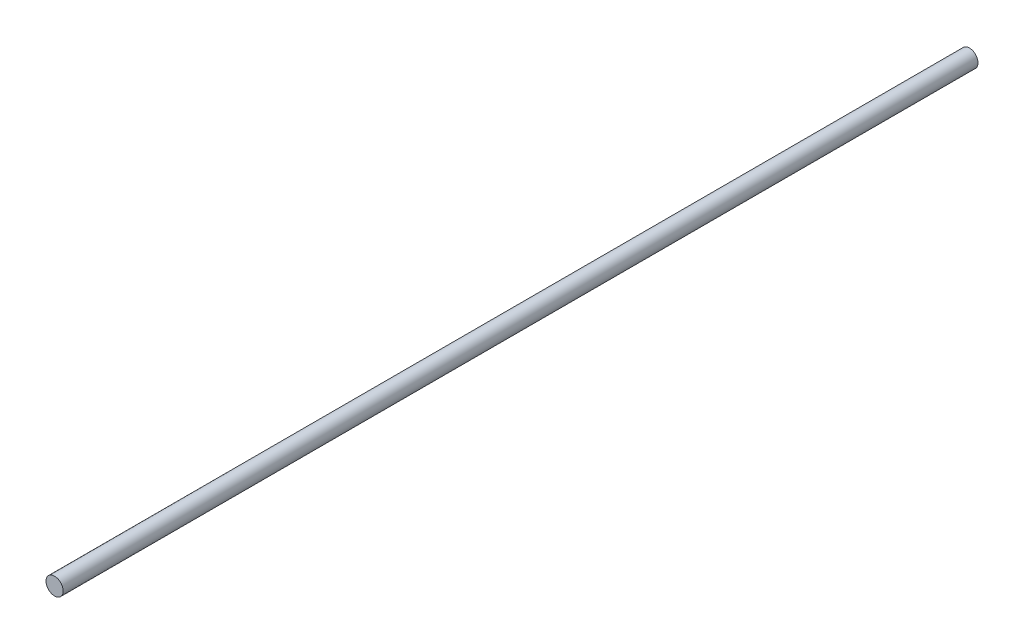
ISO-10303-21;
HEADER;
FILE_DESCRIPTION(('STEP AP214'),'2;1');
FILE_NAME('part.step','',(''),(''),'','','');
FILE_SCHEMA(('AUTOMOTIVE_DESIGN { 1 0 10303 214 1 1 1 1 }'));
ENDSEC;
DATA;
#1=APPLICATION_CONTEXT('core data for automotive mechanical design processes');
#2=APPLICATION_PROTOCOL_DEFINITION('international standard','automotive_design',2000,#1);
#3=PRODUCT_CONTEXT('',#1,'mechanical');
#4=PRODUCT('Part','Part','',(#3));
#5=PRODUCT_RELATED_PRODUCT_CATEGORY('part','',(#4));
#6=PRODUCT_DEFINITION_FORMATION('','',#4);
#7=PRODUCT_DEFINITION_CONTEXT('part definition',#1,'design');
#8=PRODUCT_DEFINITION('design','',#6,#7);
#9=PRODUCT_DEFINITION_SHAPE('','',#8);
#10=(LENGTH_UNIT() NAMED_UNIT(*) SI_UNIT(.MILLI.,.METRE.));
#11=(NAMED_UNIT(*) PLANE_ANGLE_UNIT() SI_UNIT($,.RADIAN.));
#12=(NAMED_UNIT(*) SI_UNIT($,.STERADIAN.) SOLID_ANGLE_UNIT());
#13=UNCERTAINTY_MEASURE_WITH_UNIT(LENGTH_MEASURE(1.E-05),#10,'distance_accuracy_value','');
#14=(GEOMETRIC_REPRESENTATION_CONTEXT(3) GLOBAL_UNCERTAINTY_ASSIGNED_CONTEXT((#13)) GLOBAL_UNIT_ASSIGNED_CONTEXT((#10,
#11,#12)) REPRESENTATION_CONTEXT('',''));
#15=CARTESIAN_POINT('',(0.,0.,0.));
#16=DIRECTION('',(0.,0.,1.));
#17=DIRECTION('',(1.,0.,0.));
#18=AXIS2_PLACEMENT_3D('',#15,#16,#17);
#19=CARTESIAN_POINT('',(0.,0.,426.));
#20=DIRECTION('',(0.,0.,-1.));
#21=DIRECTION('',(-1.,0.,0.));
#22=AXIS2_PLACEMENT_3D('',#19,#20,#21);
#23=CYLINDRICAL_SURFACE('',#22,4.);
#24=CARTESIAN_POINT('',(0.,0.,426.));
#25=DIRECTION('',(0.,0.,1.));
#26=DIRECTION('',(1.,0.,0.));
#27=AXIS2_PLACEMENT_3D('',#24,#25,#26);
#28=CIRCLE('',#27,4.);
#29=CARTESIAN_POINT('',(4.,0.,426.));
#30=VERTEX_POINT('',#29);
#31=EDGE_CURVE('E10',#30,#30,#28,.T.);
#32=ORIENTED_EDGE('',*,*,#31,.F.);
#33=EDGE_LOOP('',(#32));
#34=FACE_BOUND('',#33,.T.);
#35=CARTESIAN_POINT('',(0.,0.,0.));
#36=DIRECTION('',(0.,0.,1.));
#37=DIRECTION('',(1.,0.,0.));
#38=AXIS2_PLACEMENT_3D('',#35,#36,#37);
#39=CIRCLE('',#38,4.);
#40=CARTESIAN_POINT('',(4.,0.,0.));
#41=VERTEX_POINT('',#40);
#42=EDGE_CURVE('E40',#41,#41,#39,.T.);
#43=ORIENTED_EDGE('',*,*,#42,.T.);
#44=EDGE_LOOP('',(#43));
#45=FACE_BOUND('',#44,.T.);
#46=ADVANCED_FACE('F37',(#34,#45),#23,.T.);
#47=CARTESIAN_POINT('',(0.,0.,426.));
#48=DIRECTION('',(0.,0.,1.));
#49=DIRECTION('',(1.,0.,0.));
#50=AXIS2_PLACEMENT_3D('',#47,#48,#49);
#51=PLANE('',#50);
#52=ORIENTED_EDGE('',*,*,#31,.T.);
#53=EDGE_LOOP('',(#52));
#54=FACE_BOUND('',#53,.T.);
#55=ADVANCED_FACE('F53',(#54),#51,.T.);
#56=CARTESIAN_POINT('',(0.,0.,0.));
#57=DIRECTION('',(0.,0.,1.));
#58=DIRECTION('',(1.,0.,0.));
#59=AXIS2_PLACEMENT_3D('',#56,#57,#58);
#60=PLANE('',#59);
#61=ORIENTED_EDGE('',*,*,#42,.F.);
#62=EDGE_LOOP('',(#61));
#63=FACE_BOUND('',#62,.T.);
#64=ADVANCED_FACE('F51',(#63),#60,.F.);
#65=CLOSED_SHELL('',(#46,#55,#64));
#66=MANIFOLD_SOLID_BREP('B2',#65);
#67=ADVANCED_BREP_SHAPE_REPRESENTATION('',(#18,#66),#14);
#68=SHAPE_DEFINITION_REPRESENTATION(#9,#67);
ENDSEC;
END-ISO-10303-21;
